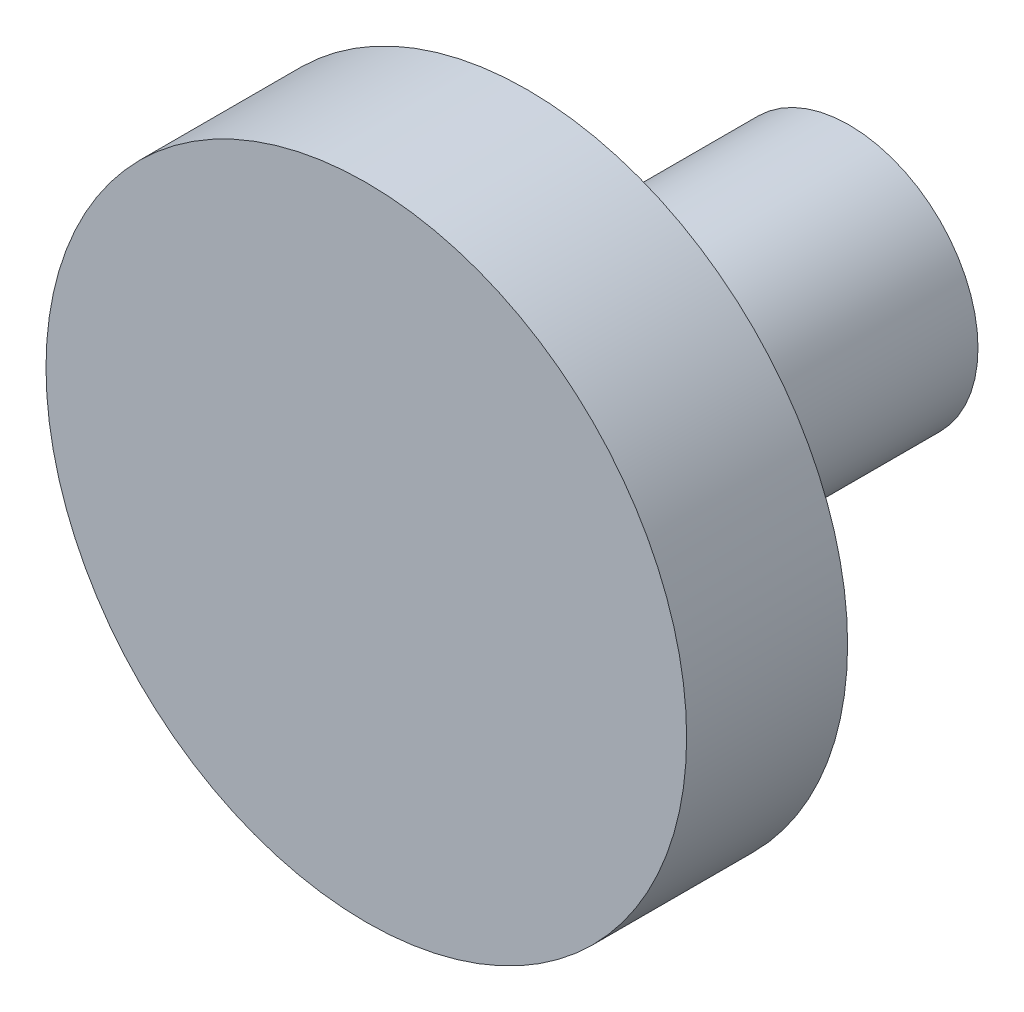
ISO-10303-21;
HEADER;
FILE_DESCRIPTION(('STEP AP214'),'2;1');
FILE_NAME('part.step','',(''),(''),'','','');
FILE_SCHEMA(('AUTOMOTIVE_DESIGN { 1 0 10303 214 1 1 1 1 }'));
ENDSEC;
DATA;
#1=APPLICATION_CONTEXT('core data for automotive mechanical design processes');
#2=APPLICATION_PROTOCOL_DEFINITION('international standard','automotive_design',2000,#1);
#3=PRODUCT_CONTEXT('',#1,'mechanical');
#4=PRODUCT('Part','Part','',(#3));
#5=PRODUCT_RELATED_PRODUCT_CATEGORY('part','',(#4));
#6=PRODUCT_DEFINITION_FORMATION('','',#4);
#7=PRODUCT_DEFINITION_CONTEXT('part definition',#1,'design');
#8=PRODUCT_DEFINITION('design','',#6,#7);
#9=PRODUCT_DEFINITION_SHAPE('','',#8);
#10=(LENGTH_UNIT() NAMED_UNIT(*) SI_UNIT(.MILLI.,.METRE.));
#11=(NAMED_UNIT(*) PLANE_ANGLE_UNIT() SI_UNIT($,.RADIAN.));
#12=(NAMED_UNIT(*) SI_UNIT($,.STERADIAN.) SOLID_ANGLE_UNIT());
#13=UNCERTAINTY_MEASURE_WITH_UNIT(LENGTH_MEASURE(1.E-05),#10,'distance_accuracy_value','');
#14=(GEOMETRIC_REPRESENTATION_CONTEXT(3) GLOBAL_UNCERTAINTY_ASSIGNED_CONTEXT((#13)) GLOBAL_UNIT_ASSIGNED_CONTEXT((#10,
#11,#12)) REPRESENTATION_CONTEXT('',''));
#15=CARTESIAN_POINT('',(0.,0.,0.));
#16=DIRECTION('',(0.,0.,1.));
#17=DIRECTION('',(1.,0.,0.));
#18=AXIS2_PLACEMENT_3D('',#15,#16,#17);
#19=CARTESIAN_POINT('',(0.,0.,5.));
#20=DIRECTION('',(0.,0.,-1.));
#21=DIRECTION('',(-1.,0.,0.));
#22=AXIS2_PLACEMENT_3D('',#19,#20,#21);
#23=CYLINDRICAL_SURFACE('',#22,9.95);
#24=CARTESIAN_POINT('',(0.,0.,5.));
#25=DIRECTION('',(0.,0.,1.));
#26=DIRECTION('',(1.,0.,0.));
#27=AXIS2_PLACEMENT_3D('',#24,#25,#26);
#28=CIRCLE('',#27,9.95);
#29=CARTESIAN_POINT('',(9.95,0.,5.));
#30=VERTEX_POINT('',#29);
#31=EDGE_CURVE('E45',#30,#30,#28,.T.);
#32=ORIENTED_EDGE('',*,*,#31,.F.);
#33=EDGE_LOOP('',(#32));
#34=FACE_BOUND('',#33,.T.);
#35=CARTESIAN_POINT('',(0.,0.,0.));
#36=DIRECTION('',(0.,0.,1.));
#37=DIRECTION('',(1.,0.,0.));
#38=AXIS2_PLACEMENT_3D('',#35,#36,#37);
#39=CIRCLE('',#38,9.95);
#40=CARTESIAN_POINT('',(9.95,0.,0.));
#41=VERTEX_POINT('',#40);
#42=EDGE_CURVE('E40',#41,#41,#39,.T.);
#43=ORIENTED_EDGE('',*,*,#42,.T.);
#44=EDGE_LOOP('',(#43));
#45=FACE_BOUND('',#44,.T.);
#46=ADVANCED_FACE('F37',(#34,#45),#23,.T.);
#47=CARTESIAN_POINT('',(0.,0.,5.));
#48=DIRECTION('',(0.,0.,1.));
#49=DIRECTION('',(1.,0.,0.));
#50=AXIS2_PLACEMENT_3D('',#47,#48,#49);
#51=PLANE('',#50);
#52=ORIENTED_EDGE('',*,*,#31,.T.);
#53=EDGE_LOOP('',(#52));
#54=FACE_BOUND('',#53,.T.);
#55=ADVANCED_FACE('F65',(#54),#51,.T.);
#56=CARTESIAN_POINT('',(0.,0.,0.));
#57=DIRECTION('',(0.,0.,1.));
#58=DIRECTION('',(1.,0.,0.));
#59=AXIS2_PLACEMENT_3D('',#56,#57,#58);
#60=PLANE('',#59);
#61=CARTESIAN_POINT('',(0.,0.,0.));
#62=DIRECTION('',(0.,0.,-1.));
#63=DIRECTION('',(-1.,0.,0.));
#64=AXIS2_PLACEMENT_3D('',#61,#62,#63);
#65=CIRCLE('',#64,4.);
#66=CARTESIAN_POINT('',(-4.,0.,0.));
#67=VERTEX_POINT('',#66);
#68=EDGE_CURVE('E10',#67,#67,#65,.T.);
#69=ORIENTED_EDGE('',*,*,#68,.F.);
#70=EDGE_LOOP('',(#69));
#71=FACE_BOUND('',#70,.T.);
#72=ORIENTED_EDGE('',*,*,#42,.F.);
#73=EDGE_LOOP('',(#72));
#74=FACE_BOUND('',#73,.T.);
#75=ADVANCED_FACE('F62',(#71,#74),#60,.F.);
#76=CARTESIAN_POINT('',(0.,0.,-10.));
#77=DIRECTION('',(0.,0.,1.));
#78=DIRECTION('',(1.,0.,0.));
#79=AXIS2_PLACEMENT_3D('',#76,#77,#78);
#80=CYLINDRICAL_SURFACE('',#79,4.);
#81=CARTESIAN_POINT('',(0.,0.,-10.));
#82=DIRECTION('',(0.,0.,-1.));
#83=DIRECTION('',(-1.,0.,0.));
#84=AXIS2_PLACEMENT_3D('',#81,#82,#83);
#85=CIRCLE('',#84,4.);
#86=CARTESIAN_POINT('',(-4.,0.,-10.));
#87=VERTEX_POINT('',#86);
#88=EDGE_CURVE('E52',#87,#87,#85,.T.);
#89=ORIENTED_EDGE('',*,*,#88,.F.);
#90=EDGE_LOOP('',(#89));
#91=FACE_BOUND('',#90,.T.);
#92=ORIENTED_EDGE('',*,*,#68,.T.);
#93=EDGE_LOOP('',(#92));
#94=FACE_BOUND('',#93,.T.);
#95=ADVANCED_FACE('F64',(#91,#94),#80,.T.);
#96=CARTESIAN_POINT('',(0.,0.,-10.));
#97=DIRECTION('',(0.,0.,-1.));
#98=DIRECTION('',(-1.,0.,0.));
#99=AXIS2_PLACEMENT_3D('',#96,#97,#98);
#100=PLANE('',#99);
#101=ORIENTED_EDGE('',*,*,#88,.T.);
#102=EDGE_LOOP('',(#101));
#103=FACE_BOUND('',#102,.T.);
#104=ADVANCED_FACE('F71',(#103),#100,.T.);
#105=CLOSED_SHELL('',(#46,#55,#75,#95,#104));
#106=MANIFOLD_SOLID_BREP('B2',#105);
#107=ADVANCED_BREP_SHAPE_REPRESENTATION('',(#18,#106),#14);
#108=SHAPE_DEFINITION_REPRESENTATION(#9,#107);
ENDSEC;
END-ISO-10303-21;
